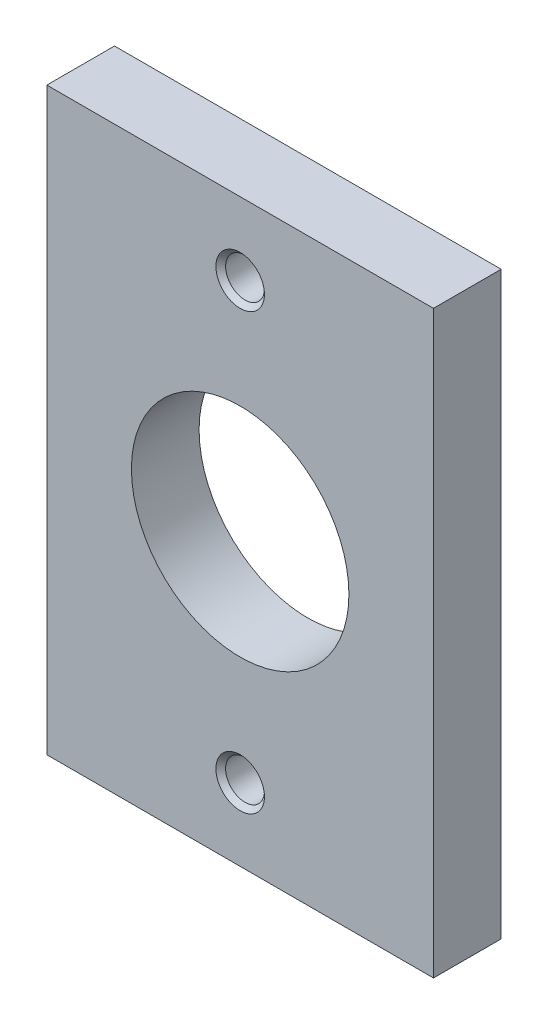
ISO-10303-21;
HEADER;
FILE_DESCRIPTION(('STEP AP214'),'2;1');
FILE_NAME('part.step','',(''),(''),'','','');
FILE_SCHEMA(('AUTOMOTIVE_DESIGN { 1 0 10303 214 1 1 1 1 }'));
ENDSEC;
DATA;
#1=APPLICATION_CONTEXT('core data for automotive mechanical design processes');
#2=APPLICATION_PROTOCOL_DEFINITION('international standard','automotive_design',2000,#1);
#3=PRODUCT_CONTEXT('',#1,'mechanical');
#4=PRODUCT('Part','Part','',(#3));
#5=PRODUCT_RELATED_PRODUCT_CATEGORY('part','',(#4));
#6=PRODUCT_DEFINITION_FORMATION('','',#4);
#7=PRODUCT_DEFINITION_CONTEXT('part definition',#1,'design');
#8=PRODUCT_DEFINITION('design','',#6,#7);
#9=PRODUCT_DEFINITION_SHAPE('','',#8);
#10=(LENGTH_UNIT() NAMED_UNIT(*) SI_UNIT(.MILLI.,.METRE.));
#11=(NAMED_UNIT(*) PLANE_ANGLE_UNIT() SI_UNIT($,.RADIAN.));
#12=(NAMED_UNIT(*) SI_UNIT($,.STERADIAN.) SOLID_ANGLE_UNIT());
#13=UNCERTAINTY_MEASURE_WITH_UNIT(LENGTH_MEASURE(1.E-05),#10,'distance_accuracy_value','');
#14=(GEOMETRIC_REPRESENTATION_CONTEXT(3) GLOBAL_UNCERTAINTY_ASSIGNED_CONTEXT((#13)) GLOBAL_UNIT_ASSIGNED_CONTEXT((#10,
#11,#12)) REPRESENTATION_CONTEXT('',''));
#15=CARTESIAN_POINT('',(0.,0.,0.));
#16=DIRECTION('',(0.,0.,1.));
#17=DIRECTION('',(1.,0.,0.));
#18=AXIS2_PLACEMENT_3D('',#15,#16,#17);
#19=CARTESIAN_POINT('',(0.,0.,8.89));
#20=DIRECTION('',(0.,0.,-1.));
#21=DIRECTION('',(-1.,0.,0.));
#22=AXIS2_PLACEMENT_3D('',#19,#20,#21);
#23=PLANE('',#22);
#24=CARTESIAN_POINT('',(25.4,66.675,8.89));
#25=DIRECTION('',(0.,0.,1.));
#26=DIRECTION('',(1.,0.,0.));
#27=AXIS2_PLACEMENT_3D('',#24,#25,#26);
#28=CIRCLE('',#27,3.1877);
#29=CARTESIAN_POINT('',(28.5877,66.675,8.89));
#30=VERTEX_POINT('',#29);
#31=EDGE_CURVE('E134',#30,#30,#28,.T.);
#32=ORIENTED_EDGE('',*,*,#31,.F.);
#33=EDGE_LOOP('',(#32));
#34=FACE_BOUND('',#33,.T.);
#35=CARTESIAN_POINT('',(25.4,9.525,8.89));
#36=DIRECTION('',(0.,0.,1.));
#37=DIRECTION('',(1.,0.,0.));
#38=AXIS2_PLACEMENT_3D('',#35,#36,#37);
#39=CIRCLE('',#38,3.1877);
#40=CARTESIAN_POINT('',(28.5877,9.525,8.89));
#41=VERTEX_POINT('',#40);
#42=EDGE_CURVE('E125',#41,#41,#39,.T.);
#43=ORIENTED_EDGE('',*,*,#42,.F.);
#44=EDGE_LOOP('',(#43));
#45=FACE_BOUND('',#44,.T.);
#46=DIRECTION('',(0.,-1.,0.));
#47=VECTOR('',#46,1.);
#48=CARTESIAN_POINT('',(0.,0.,8.89));
#49=LINE('',#48,#47);
#50=CARTESIAN_POINT('',(0.,76.2,8.89));
#51=VERTEX_POINT('',#50);
#52=CARTESIAN_POINT('',(0.,0.,8.89));
#53=VERTEX_POINT('',#52);
#54=EDGE_CURVE('E87',#51,#53,#49,.T.);
#55=ORIENTED_EDGE('',*,*,#54,.T.);
#56=DIRECTION('',(1.,0.,0.));
#57=VECTOR('',#56,1.);
#58=CARTESIAN_POINT('',(0.,0.,8.89));
#59=LINE('',#58,#57);
#60=CARTESIAN_POINT('',(50.8,0.,8.89));
#61=VERTEX_POINT('',#60);
#62=EDGE_CURVE('E82',#53,#61,#59,.T.);
#63=ORIENTED_EDGE('',*,*,#62,.T.);
#64=DIRECTION('',(0.,1.,0.));
#65=VECTOR('',#64,1.);
#66=CARTESIAN_POINT('',(50.8,0.,8.89));
#67=LINE('',#66,#65);
#68=CARTESIAN_POINT('',(50.8,76.2,8.89));
#69=VERTEX_POINT('',#68);
#70=EDGE_CURVE('E85',#61,#69,#67,.T.);
#71=ORIENTED_EDGE('',*,*,#70,.T.);
#72=DIRECTION('',(-1.,0.,0.));
#73=VECTOR('',#72,1.);
#74=CARTESIAN_POINT('',(0.,76.2,8.89));
#75=LINE('',#74,#73);
#76=EDGE_CURVE('E52',#69,#51,#75,.T.);
#77=ORIENTED_EDGE('',*,*,#76,.T.);
#78=EDGE_LOOP('',(#55,#63,#71,#77));
#79=FACE_BOUND('',#78,.T.);
#80=CARTESIAN_POINT('',(25.4,38.1,8.89));
#81=DIRECTION('',(0.,0.,1.));
#82=DIRECTION('',(1.,0.,0.));
#83=AXIS2_PLACEMENT_3D('',#80,#81,#82);
#84=CIRCLE('',#83,14.2875);
#85=CARTESIAN_POINT('',(39.6875,38.1,8.89));
#86=VERTEX_POINT('',#85);
#87=EDGE_CURVE('E102',#86,#86,#84,.T.);
#88=ORIENTED_EDGE('',*,*,#87,.F.);
#89=EDGE_LOOP('',(#88));
#90=FACE_BOUND('',#89,.T.);
#91=ADVANCED_FACE('F35',(#34,#45,#79,#90),#23,.F.);
#92=CARTESIAN_POINT('',(0.,0.,0.));
#93=DIRECTION('',(0.,0.,-1.));
#94=DIRECTION('',(-1.,0.,0.));
#95=AXIS2_PLACEMENT_3D('',#92,#93,#94);
#96=PLANE('',#95);
#97=CARTESIAN_POINT('',(25.4,66.675,0.));
#98=DIRECTION('',(0.,0.,1.));
#99=DIRECTION('',(1.,0.,0.));
#100=AXIS2_PLACEMENT_3D('',#97,#98,#99);
#101=CIRCLE('',#100,2.55269999999999);
#102=CARTESIAN_POINT('',(27.9527,66.675,0.));
#103=VERTEX_POINT('',#102);
#104=EDGE_CURVE('E128',#103,#103,#101,.T.);
#105=ORIENTED_EDGE('',*,*,#104,.T.);
#106=EDGE_LOOP('',(#105));
#107=FACE_BOUND('',#106,.T.);
#108=CARTESIAN_POINT('',(25.4,9.525,0.));
#109=DIRECTION('',(0.,0.,1.));
#110=DIRECTION('',(1.,0.,0.));
#111=AXIS2_PLACEMENT_3D('',#108,#109,#110);
#112=CIRCLE('',#111,2.55269999999999);
#113=CARTESIAN_POINT('',(27.9527,9.525,0.));
#114=VERTEX_POINT('',#113);
#115=EDGE_CURVE('E117',#114,#114,#112,.T.);
#116=ORIENTED_EDGE('',*,*,#115,.T.);
#117=EDGE_LOOP('',(#116));
#118=FACE_BOUND('',#117,.T.);
#119=DIRECTION('',(0.,-1.,0.));
#120=VECTOR('',#119,1.);
#121=CARTESIAN_POINT('',(0.,0.,0.));
#122=LINE('',#121,#120);
#123=CARTESIAN_POINT('',(0.,76.2,0.));
#124=VERTEX_POINT('',#123);
#125=CARTESIAN_POINT('',(0.,0.,0.));
#126=VERTEX_POINT('',#125);
#127=EDGE_CURVE('E99',#124,#126,#122,.T.);
#128=ORIENTED_EDGE('',*,*,#127,.F.);
#129=DIRECTION('',(-1.,0.,0.));
#130=VECTOR('',#129,1.);
#131=CARTESIAN_POINT('',(0.,76.2,0.));
#132=LINE('',#131,#130);
#133=CARTESIAN_POINT('',(50.8,76.2,0.));
#134=VERTEX_POINT('',#133);
#135=EDGE_CURVE('E75',#134,#124,#132,.T.);
#136=ORIENTED_EDGE('',*,*,#135,.F.);
#137=DIRECTION('',(0.,1.,0.));
#138=VECTOR('',#137,1.);
#139=CARTESIAN_POINT('',(50.8,0.,0.));
#140=LINE('',#139,#138);
#141=CARTESIAN_POINT('',(50.8,0.,0.));
#142=VERTEX_POINT('',#141);
#143=EDGE_CURVE('E69',#142,#134,#140,.T.);
#144=ORIENTED_EDGE('',*,*,#143,.F.);
#145=DIRECTION('',(1.,0.,0.));
#146=VECTOR('',#145,1.);
#147=CARTESIAN_POINT('',(0.,0.,0.));
#148=LINE('',#147,#146);
#149=EDGE_CURVE('E91',#126,#142,#148,.T.);
#150=ORIENTED_EDGE('',*,*,#149,.F.);
#151=EDGE_LOOP('',(#128,#136,#144,#150));
#152=FACE_BOUND('',#151,.T.);
#153=CARTESIAN_POINT('',(25.4,38.1,0.));
#154=DIRECTION('',(0.,0.,1.));
#155=DIRECTION('',(1.,0.,0.));
#156=AXIS2_PLACEMENT_3D('',#153,#154,#155);
#157=CIRCLE('',#156,14.2875);
#158=CARTESIAN_POINT('',(39.6875,38.1,0.));
#159=VERTEX_POINT('',#158);
#160=EDGE_CURVE('E114',#159,#159,#157,.T.);
#161=ORIENTED_EDGE('',*,*,#160,.T.);
#162=EDGE_LOOP('',(#161));
#163=FACE_BOUND('',#162,.T.);
#164=ADVANCED_FACE('F110',(#107,#118,#152,#163),#96,.T.);
#165=CARTESIAN_POINT('',(0.,0.,8.89));
#166=DIRECTION('',(1.,0.,0.));
#167=DIRECTION('',(0.,0.,-1.));
#168=AXIS2_PLACEMENT_3D('',#165,#166,#167);
#169=PLANE('',#168);
#170=ORIENTED_EDGE('',*,*,#127,.T.);
#171=DIRECTION('',(0.,0.,-1.));
#172=VECTOR('',#171,1.);
#173=CARTESIAN_POINT('',(0.,0.,8.89));
#174=LINE('',#173,#172);
#175=EDGE_CURVE('E11',#53,#126,#174,.T.);
#176=ORIENTED_EDGE('',*,*,#175,.F.);
#177=ORIENTED_EDGE('',*,*,#54,.F.);
#178=DIRECTION('',(0.,0.,-1.));
#179=VECTOR('',#178,1.);
#180=CARTESIAN_POINT('',(0.,76.2,8.89));
#181=LINE('',#180,#179);
#182=EDGE_CURVE('E95',#51,#124,#181,.T.);
#183=ORIENTED_EDGE('',*,*,#182,.T.);
#184=EDGE_LOOP('',(#170,#176,#177,#183));
#185=FACE_BOUND('',#184,.T.);
#186=ADVANCED_FACE('F37',(#185),#169,.F.);
#187=CARTESIAN_POINT('',(0.,0.,8.89));
#188=DIRECTION('',(0.,1.,0.));
#189=DIRECTION('',(0.,0.,1.));
#190=AXIS2_PLACEMENT_3D('',#187,#188,#189);
#191=PLANE('',#190);
#192=ORIENTED_EDGE('',*,*,#149,.T.);
#193=DIRECTION('',(0.,0.,-1.));
#194=VECTOR('',#193,1.);
#195=CARTESIAN_POINT('',(50.8,0.,8.89));
#196=LINE('',#195,#194);
#197=EDGE_CURVE('E44',#61,#142,#196,.T.);
#198=ORIENTED_EDGE('',*,*,#197,.F.);
#199=ORIENTED_EDGE('',*,*,#62,.F.);
#200=ORIENTED_EDGE('',*,*,#175,.T.);
#201=EDGE_LOOP('',(#192,#198,#199,#200));
#202=FACE_BOUND('',#201,.T.);
#203=ADVANCED_FACE('F90',(#202),#191,.F.);
#204=CARTESIAN_POINT('',(50.8,0.,8.89));
#205=DIRECTION('',(-1.,0.,0.));
#206=DIRECTION('',(0.,0.,1.));
#207=AXIS2_PLACEMENT_3D('',#204,#205,#206);
#208=PLANE('',#207);
#209=ORIENTED_EDGE('',*,*,#143,.T.);
#210=DIRECTION('',(0.,0.,-1.));
#211=VECTOR('',#210,1.);
#212=CARTESIAN_POINT('',(50.8,76.2,8.89));
#213=LINE('',#212,#211);
#214=EDGE_CURVE('E92',#69,#134,#213,.T.);
#215=ORIENTED_EDGE('',*,*,#214,.F.);
#216=ORIENTED_EDGE('',*,*,#70,.F.);
#217=ORIENTED_EDGE('',*,*,#197,.T.);
#218=EDGE_LOOP('',(#209,#215,#216,#217));
#219=FACE_BOUND('',#218,.T.);
#220=ADVANCED_FACE('F93',(#219),#208,.F.);
#221=CARTESIAN_POINT('',(0.,76.2,8.89));
#222=DIRECTION('',(0.,-1.,0.));
#223=DIRECTION('',(0.,0.,-1.));
#224=AXIS2_PLACEMENT_3D('',#221,#222,#223);
#225=PLANE('',#224);
#226=ORIENTED_EDGE('',*,*,#135,.T.);
#227=ORIENTED_EDGE('',*,*,#182,.F.);
#228=ORIENTED_EDGE('',*,*,#76,.F.);
#229=ORIENTED_EDGE('',*,*,#214,.T.);
#230=EDGE_LOOP('',(#226,#227,#228,#229));
#231=FACE_BOUND('',#230,.T.);
#232=ADVANCED_FACE('F107',(#231),#225,.F.);
#233=CARTESIAN_POINT('',(25.4,38.1,8.89));
#234=DIRECTION('',(0.,0.,-1.));
#235=DIRECTION('',(-1.,0.,0.));
#236=AXIS2_PLACEMENT_3D('',#233,#234,#235);
#237=CYLINDRICAL_SURFACE('',#236,14.2875);
#238=ORIENTED_EDGE('',*,*,#87,.T.);
#239=EDGE_LOOP('',(#238));
#240=FACE_BOUND('',#239,.T.);
#241=ORIENTED_EDGE('',*,*,#160,.F.);
#242=EDGE_LOOP('',(#241));
#243=FACE_BOUND('',#242,.T.);
#244=ADVANCED_FACE('F157',(#240,#243),#237,.F.);
#245=CARTESIAN_POINT('',(25.4,9.525,8.89));
#246=DIRECTION('',(0.,0.,1.));
#247=DIRECTION('',(1.,0.,0.));
#248=AXIS2_PLACEMENT_3D('',#245,#246,#247);
#249=CYLINDRICAL_SURFACE('',#248,2.55269999999999);
#250=ORIENTED_EDGE('',*,*,#115,.F.);
#251=EDGE_LOOP('',(#250));
#252=FACE_BOUND('',#251,.T.);
#253=CARTESIAN_POINT('',(25.4,9.525,8.255));
#254=DIRECTION('',(0.,0.,1.));
#255=DIRECTION('',(1.,0.,0.));
#256=AXIS2_PLACEMENT_3D('',#253,#254,#255);
#257=CIRCLE('',#256,2.5527);
#258=CARTESIAN_POINT('',(27.9527,9.525,8.255));
#259=VERTEX_POINT('',#258);
#260=EDGE_CURVE('E122',#259,#259,#257,.T.);
#261=ORIENTED_EDGE('',*,*,#260,.T.);
#262=EDGE_LOOP('',(#261));
#263=FACE_BOUND('',#262,.T.);
#264=ADVANCED_FACE('F148',(#252,#263),#249,.F.);
#265=CARTESIAN_POINT('',(25.4,9.525,8.89));
#266=DIRECTION('',(0.,0.,1.));
#267=DIRECTION('',(1.,0.,0.));
#268=AXIS2_PLACEMENT_3D('',#265,#266,#267);
#269=CONICAL_SURFACE('',#268,3.1877,0.78539816339745);
#270=ORIENTED_EDGE('',*,*,#260,.F.);
#271=EDGE_LOOP('',(#270));
#272=FACE_BOUND('',#271,.T.);
#273=ORIENTED_EDGE('',*,*,#42,.T.);
#274=EDGE_LOOP('',(#273));
#275=FACE_BOUND('',#274,.T.);
#276=ADVANCED_FACE('F145',(#272,#275),#269,.F.);
#277=CARTESIAN_POINT('',(25.4,66.675,8.89));
#278=DIRECTION('',(0.,0.,1.));
#279=DIRECTION('',(1.,0.,0.));
#280=AXIS2_PLACEMENT_3D('',#277,#278,#279);
#281=CYLINDRICAL_SURFACE('',#280,2.55269999999999);
#282=ORIENTED_EDGE('',*,*,#104,.F.);
#283=EDGE_LOOP('',(#282));
#284=FACE_BOUND('',#283,.T.);
#285=CARTESIAN_POINT('',(25.4,66.675,8.255));
#286=DIRECTION('',(0.,0.,1.));
#287=DIRECTION('',(1.,0.,0.));
#288=AXIS2_PLACEMENT_3D('',#285,#286,#287);
#289=CIRCLE('',#288,2.5527);
#290=CARTESIAN_POINT('',(27.9527,66.675,8.255));
#291=VERTEX_POINT('',#290);
#292=EDGE_CURVE('E131',#291,#291,#289,.T.);
#293=ORIENTED_EDGE('',*,*,#292,.T.);
#294=EDGE_LOOP('',(#293));
#295=FACE_BOUND('',#294,.T.);
#296=ADVANCED_FACE('F147',(#284,#295),#281,.F.);
#297=CARTESIAN_POINT('',(25.4,66.675,8.89));
#298=DIRECTION('',(0.,0.,1.));
#299=DIRECTION('',(1.,0.,0.));
#300=AXIS2_PLACEMENT_3D('',#297,#298,#299);
#301=CONICAL_SURFACE('',#300,3.1877,0.78539816339745);
#302=ORIENTED_EDGE('',*,*,#292,.F.);
#303=EDGE_LOOP('',(#302));
#304=FACE_BOUND('',#303,.T.);
#305=ORIENTED_EDGE('',*,*,#31,.T.);
#306=EDGE_LOOP('',(#305));
#307=FACE_BOUND('',#306,.T.);
#308=ADVANCED_FACE('F138',(#304,#307),#301,.F.);
#309=CLOSED_SHELL('',(#91,#164,#186,#203,#220,#232,#244,#264,#276,#296,#308));
#310=MANIFOLD_SOLID_BREP('B2',#309);
#311=ADVANCED_BREP_SHAPE_REPRESENTATION('',(#18,#310),#14);
#312=SHAPE_DEFINITION_REPRESENTATION(#9,#311);
ENDSEC;
END-ISO-10303-21;
